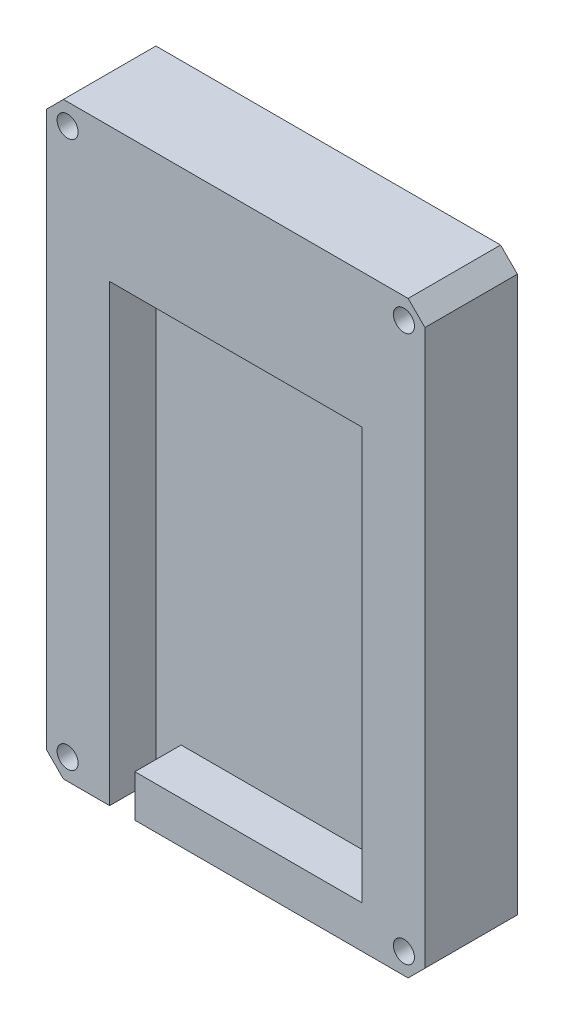
ISO-10303-21;
HEADER;
FILE_DESCRIPTION(('STEP AP214'),'2;1');
FILE_NAME('part.step','',(''),(''),'','','');
FILE_SCHEMA(('AUTOMOTIVE_DESIGN { 1 0 10303 214 1 1 1 1 }'));
ENDSEC;
DATA;
#1=APPLICATION_CONTEXT('core data for automotive mechanical design processes');
#2=APPLICATION_PROTOCOL_DEFINITION('international standard','automotive_design',2000,#1);
#3=PRODUCT_CONTEXT('',#1,'mechanical');
#4=PRODUCT('Part','Part','',(#3));
#5=PRODUCT_RELATED_PRODUCT_CATEGORY('part','',(#4));
#6=PRODUCT_DEFINITION_FORMATION('','',#4);
#7=PRODUCT_DEFINITION_CONTEXT('part definition',#1,'design');
#8=PRODUCT_DEFINITION('design','',#6,#7);
#9=PRODUCT_DEFINITION_SHAPE('','',#8);
#10=(LENGTH_UNIT() NAMED_UNIT(*) SI_UNIT(.MILLI.,.METRE.));
#11=(NAMED_UNIT(*) PLANE_ANGLE_UNIT() SI_UNIT($,.RADIAN.));
#12=(NAMED_UNIT(*) SI_UNIT($,.STERADIAN.) SOLID_ANGLE_UNIT());
#13=UNCERTAINTY_MEASURE_WITH_UNIT(LENGTH_MEASURE(1.E-05),#10,'distance_accuracy_value','');
#14=(GEOMETRIC_REPRESENTATION_CONTEXT(3) GLOBAL_UNCERTAINTY_ASSIGNED_CONTEXT((#13)) GLOBAL_UNIT_ASSIGNED_CONTEXT((#10,
#11,#12)) REPRESENTATION_CONTEXT('',''));
#15=CARTESIAN_POINT('',(0.,0.,0.));
#16=DIRECTION('',(0.,0.,1.));
#17=DIRECTION('',(1.,0.,0.));
#18=AXIS2_PLACEMENT_3D('',#15,#16,#17);
#19=CARTESIAN_POINT('',(0.,-24.5,5.5));
#20=DIRECTION('',(0.,1.,0.));
#21=DIRECTION('',(0.,0.,1.));
#22=AXIS2_PLACEMENT_3D('',#19,#20,#21);
#23=PLANE('',#22);
#24=DIRECTION('',(1.,0.,0.));
#25=VECTOR('',#24,1.);
#26=CARTESIAN_POINT('',(0.,-24.5,0.));
#27=LINE('',#26,#25);
#28=CARTESIAN_POINT('',(-12.,-24.5,0.));
#29=VERTEX_POINT('',#28);
#30=CARTESIAN_POINT('',(15.,-24.5,0.));
#31=VERTEX_POINT('',#30);
#32=EDGE_CURVE('E258',#29,#31,#27,.T.);
#33=ORIENTED_EDGE('',*,*,#32,.F.);
#34=DIRECTION('',(0.,0.,-1.));
#35=VECTOR('',#34,1.);
#36=CARTESIAN_POINT('',(-12.,-24.5,5.5));
#37=LINE('',#36,#35);
#38=CARTESIAN_POINT('',(-12.,-24.5,5.5));
#39=VERTEX_POINT('',#38);
#40=EDGE_CURVE('E188',#39,#29,#37,.T.);
#41=ORIENTED_EDGE('',*,*,#40,.F.);
#42=DIRECTION('',(1.,0.,0.));
#43=VECTOR('',#42,1.);
#44=CARTESIAN_POINT('',(0.,-24.5,5.5));
#45=LINE('',#44,#43);
#46=CARTESIAN_POINT('',(15.,-24.5,5.5));
#47=VERTEX_POINT('',#46);
#48=EDGE_CURVE('E268',#39,#47,#45,.T.);
#49=ORIENTED_EDGE('',*,*,#48,.T.);
#50=DIRECTION('',(0.,0.,-1.));
#51=VECTOR('',#50,1.);
#52=CARTESIAN_POINT('',(15.,-24.5,5.5));
#53=LINE('',#52,#51);
#54=EDGE_CURVE('E298',#47,#31,#53,.T.);
#55=ORIENTED_EDGE('',*,*,#54,.T.);
#56=EDGE_LOOP('',(#33,#41,#49,#55));
#57=FACE_BOUND('',#56,.T.);
#58=ADVANCED_FACE('F49',(#57),#23,.T.);
#59=CARTESIAN_POINT('',(-12.,0.,5.5));
#60=DIRECTION('',(1.,0.,0.));
#61=DIRECTION('',(0.,0.,-1.));
#62=AXIS2_PLACEMENT_3D('',#59,#60,#61);
#63=PLANE('',#62);
#64=DIRECTION('',(0.,-1.,0.));
#65=VECTOR('',#64,1.);
#66=CARTESIAN_POINT('',(-12.,0.,0.));
#67=LINE('',#66,#65);
#68=CARTESIAN_POINT('',(-12.,-29.5,0.));
#69=VERTEX_POINT('',#68);
#70=EDGE_CURVE('E163',#29,#69,#67,.T.);
#71=ORIENTED_EDGE('',*,*,#70,.T.);
#72=DIRECTION('',(0.,0.,-1.));
#73=VECTOR('',#72,1.);
#74=CARTESIAN_POINT('',(-12.,-29.5,5.5));
#75=LINE('',#74,#73);
#76=CARTESIAN_POINT('',(-12.,-29.5,5.5));
#77=VERTEX_POINT('',#76);
#78=EDGE_CURVE('E175',#77,#69,#75,.T.);
#79=ORIENTED_EDGE('',*,*,#78,.F.);
#80=DIRECTION('',(0.,-1.,0.));
#81=VECTOR('',#80,1.);
#82=CARTESIAN_POINT('',(-12.,0.,5.5));
#83=LINE('',#82,#81);
#84=EDGE_CURVE('E272',#39,#77,#83,.T.);
#85=ORIENTED_EDGE('',*,*,#84,.F.);
#86=ORIENTED_EDGE('',*,*,#40,.T.);
#87=EDGE_LOOP('',(#71,#79,#85,#86));
#88=FACE_BOUND('',#87,.T.);
#89=ADVANCED_FACE('F406',(#88),#63,.F.);
#90=CARTESIAN_POINT('',(22.5,0.,5.5));
#91=DIRECTION('',(-1.,0.,0.));
#92=DIRECTION('',(0.,-1.,0.));
#93=AXIS2_PLACEMENT_3D('',#90,#91,#92);
#94=PLANE('',#93);
#95=DIRECTION('',(0.,1.,0.));
#96=VECTOR('',#95,1.);
#97=CARTESIAN_POINT('',(22.5,0.,5.5));
#98=LINE('',#97,#96);
#99=CARTESIAN_POINT('',(22.5,-27.5,5.5));
#100=VERTEX_POINT('',#99);
#101=CARTESIAN_POINT('',(22.5,38.5,5.5));
#102=VERTEX_POINT('',#101);
#103=EDGE_CURVE('E280',#100,#102,#98,.T.);
#104=ORIENTED_EDGE('',*,*,#103,.F.);
#105=DIRECTION('',(0.,0.,-1.));
#106=VECTOR('',#105,1.);
#107=CARTESIAN_POINT('',(22.5,-27.5,5.5));
#108=LINE('',#107,#106);
#109=CARTESIAN_POINT('',(22.5,-27.5,-5.5));
#110=VERTEX_POINT('',#109);
#111=EDGE_CURVE('E200',#100,#110,#108,.T.);
#112=ORIENTED_EDGE('',*,*,#111,.T.);
#113=DIRECTION('',(0.,1.,0.));
#114=VECTOR('',#113,1.);
#115=CARTESIAN_POINT('',(22.5,0.,-5.5));
#116=LINE('',#115,#114);
#117=CARTESIAN_POINT('',(22.5,38.5,-5.5));
#118=VERTEX_POINT('',#117);
#119=EDGE_CURVE('E259',#110,#118,#116,.T.);
#120=ORIENTED_EDGE('',*,*,#119,.T.);
#121=DIRECTION('',(0.,0.,1.));
#122=VECTOR('',#121,1.);
#123=CARTESIAN_POINT('',(22.5,38.5,5.5));
#124=LINE('',#123,#122);
#125=EDGE_CURVE('E197',#118,#102,#124,.T.);
#126=ORIENTED_EDGE('',*,*,#125,.T.);
#127=EDGE_LOOP('',(#104,#112,#120,#126));
#128=FACE_BOUND('',#127,.T.);
#129=ADVANCED_FACE('F412',(#128),#94,.F.);
#130=CARTESIAN_POINT('',(0.,40.5,5.5));
#131=DIRECTION('',(0.,1.,0.));
#132=DIRECTION('',(0.,0.,1.));
#133=AXIS2_PLACEMENT_3D('',#130,#131,#132);
#134=PLANE('',#133);
#135=DIRECTION('',(1.,0.,0.));
#136=VECTOR('',#135,1.);
#137=CARTESIAN_POINT('',(0.,40.5,5.5));
#138=LINE('',#137,#136);
#139=CARTESIAN_POINT('',(-20.5,40.5,5.5));
#140=VERTEX_POINT('',#139);
#141=CARTESIAN_POINT('',(20.5,40.5,5.5));
#142=VERTEX_POINT('',#141);
#143=EDGE_CURVE('E249',#140,#142,#138,.T.);
#144=ORIENTED_EDGE('',*,*,#143,.T.);
#145=DIRECTION('',(0.,0.,-1.));
#146=VECTOR('',#145,1.);
#147=CARTESIAN_POINT('',(20.5,40.5,-5.5));
#148=LINE('',#147,#146);
#149=CARTESIAN_POINT('',(20.5,40.5,-5.5));
#150=VERTEX_POINT('',#149);
#151=EDGE_CURVE('E237',#142,#150,#148,.T.);
#152=ORIENTED_EDGE('',*,*,#151,.T.);
#153=DIRECTION('',(1.,0.,0.));
#154=VECTOR('',#153,1.);
#155=CARTESIAN_POINT('',(0.,40.5,-5.5));
#156=LINE('',#155,#154);
#157=CARTESIAN_POINT('',(-20.5,40.5,-5.5));
#158=VERTEX_POINT('',#157);
#159=EDGE_CURVE('E247',#158,#150,#156,.T.);
#160=ORIENTED_EDGE('',*,*,#159,.F.);
#161=DIRECTION('',(0.,0.,1.));
#162=VECTOR('',#161,1.);
#163=CARTESIAN_POINT('',(-20.5,40.5,5.5));
#164=LINE('',#163,#162);
#165=EDGE_CURVE('E234',#158,#140,#164,.T.);
#166=ORIENTED_EDGE('',*,*,#165,.T.);
#167=EDGE_LOOP('',(#144,#152,#160,#166));
#168=FACE_BOUND('',#167,.T.);
#169=ADVANCED_FACE('F246',(#168),#134,.T.);
#170=CARTESIAN_POINT('',(-22.5,0.,5.5));
#171=DIRECTION('',(-1.,0.,0.));
#172=DIRECTION('',(0.,-1.,0.));
#173=AXIS2_PLACEMENT_3D('',#170,#171,#172);
#174=PLANE('',#173);
#175=DIRECTION('',(0.,1.,0.));
#176=VECTOR('',#175,1.);
#177=CARTESIAN_POINT('',(-22.5,0.,5.5));
#178=LINE('',#177,#176);
#179=CARTESIAN_POINT('',(-22.5,-27.5,5.5));
#180=VERTEX_POINT('',#179);
#181=CARTESIAN_POINT('',(-22.5,38.5,5.5));
#182=VERTEX_POINT('',#181);
#183=EDGE_CURVE('E287',#180,#182,#178,.T.);
#184=ORIENTED_EDGE('',*,*,#183,.T.);
#185=DIRECTION('',(0.,0.,-1.));
#186=VECTOR('',#185,1.);
#187=CARTESIAN_POINT('',(-22.5,38.5,5.5));
#188=LINE('',#187,#186);
#189=CARTESIAN_POINT('',(-22.5,38.5,-5.5));
#190=VERTEX_POINT('',#189);
#191=EDGE_CURVE('E11',#182,#190,#188,.T.);
#192=ORIENTED_EDGE('',*,*,#191,.T.);
#193=DIRECTION('',(0.,1.,0.));
#194=VECTOR('',#193,1.);
#195=CARTESIAN_POINT('',(-22.5,0.,-5.5));
#196=LINE('',#195,#194);
#197=CARTESIAN_POINT('',(-22.5,-27.5,-5.5));
#198=VERTEX_POINT('',#197);
#199=EDGE_CURVE('E177',#198,#190,#196,.T.);
#200=ORIENTED_EDGE('',*,*,#199,.F.);
#201=DIRECTION('',(0.,0.,1.));
#202=VECTOR('',#201,1.);
#203=CARTESIAN_POINT('',(-22.5,-27.5,5.5));
#204=LINE('',#203,#202);
#205=EDGE_CURVE('E59',#198,#180,#204,.T.);
#206=ORIENTED_EDGE('',*,*,#205,.T.);
#207=EDGE_LOOP('',(#184,#192,#200,#206));
#208=FACE_BOUND('',#207,.T.);
#209=ADVANCED_FACE('F324',(#208),#174,.T.);
#210=CARTESIAN_POINT('',(0.,-29.5,5.5));
#211=DIRECTION('',(0.,1.,0.));
#212=DIRECTION('',(-1.,0.,0.));
#213=AXIS2_PLACEMENT_3D('',#210,#211,#212);
#214=PLANE('',#213);
#215=DIRECTION('',(1.,0.,0.));
#216=VECTOR('',#215,1.);
#217=CARTESIAN_POINT('',(0.,-29.5,-5.5));
#218=LINE('',#217,#216);
#219=CARTESIAN_POINT('',(-20.5,-29.5,-5.5));
#220=VERTEX_POINT('',#219);
#221=CARTESIAN_POINT('',(20.5,-29.5,-5.5));
#222=VERTEX_POINT('',#221);
#223=EDGE_CURVE('E264',#220,#222,#218,.T.);
#224=ORIENTED_EDGE('',*,*,#223,.T.);
#225=DIRECTION('',(0.,0.,1.));
#226=VECTOR('',#225,1.);
#227=CARTESIAN_POINT('',(20.5,-29.5,5.5));
#228=LINE('',#227,#226);
#229=CARTESIAN_POINT('',(20.5,-29.5,5.5));
#230=VERTEX_POINT('',#229);
#231=EDGE_CURVE('E220',#222,#230,#228,.T.);
#232=ORIENTED_EDGE('',*,*,#231,.T.);
#233=DIRECTION('',(1.,0.,0.));
#234=VECTOR('',#233,1.);
#235=CARTESIAN_POINT('',(0.,-29.5,5.5));
#236=LINE('',#235,#234);
#237=EDGE_CURVE('E276',#77,#230,#236,.T.);
#238=ORIENTED_EDGE('',*,*,#237,.F.);
#239=ORIENTED_EDGE('',*,*,#78,.T.);
#240=DIRECTION('',(1.,0.,0.));
#241=VECTOR('',#240,1.);
#242=CARTESIAN_POINT('',(0.,-29.5,0.));
#243=LINE('',#242,#241);
#244=CARTESIAN_POINT('',(-15.,-29.5,0.));
#245=VERTEX_POINT('',#244);
#246=EDGE_CURVE('E155',#245,#69,#243,.T.);
#247=ORIENTED_EDGE('',*,*,#246,.F.);
#248=DIRECTION('',(0.,0.,-1.));
#249=VECTOR('',#248,1.);
#250=CARTESIAN_POINT('',(-15.,-29.5,5.5));
#251=LINE('',#250,#249);
#252=CARTESIAN_POINT('',(-15.,-29.5,5.5));
#253=VERTEX_POINT('',#252);
#254=EDGE_CURVE('E171',#253,#245,#251,.T.);
#255=ORIENTED_EDGE('',*,*,#254,.F.);
#256=CARTESIAN_POINT('',(-20.5,-29.5,5.5));
#257=VERTEX_POINT('',#256);
#258=EDGE_CURVE('E281',#257,#253,#236,.T.);
#259=ORIENTED_EDGE('',*,*,#258,.F.);
#260=DIRECTION('',(0.,0.,-1.));
#261=VECTOR('',#260,1.);
#262=CARTESIAN_POINT('',(-20.5,-29.5,-5.5));
#263=LINE('',#262,#261);
#264=EDGE_CURVE('E216',#257,#220,#263,.T.);
#265=ORIENTED_EDGE('',*,*,#264,.T.);
#266=EDGE_LOOP('',(#224,#232,#238,#239,#247,#255,#259,#265));
#267=FACE_BOUND('',#266,.T.);
#268=ADVANCED_FACE('F169',(#267),#214,.F.);
#269=CARTESIAN_POINT('',(-15.,0.,5.5));
#270=DIRECTION('',(1.,0.,0.));
#271=DIRECTION('',(0.,1.,0.));
#272=AXIS2_PLACEMENT_3D('',#269,#270,#271);
#273=PLANE('',#272);
#274=DIRECTION('',(0.,-1.,0.));
#275=VECTOR('',#274,1.);
#276=CARTESIAN_POINT('',(-15.,0.,0.));
#277=LINE('',#276,#275);
#278=CARTESIAN_POINT('',(-15.,24.5,0.));
#279=VERTEX_POINT('',#278);
#280=EDGE_CURVE('E152',#279,#245,#277,.T.);
#281=ORIENTED_EDGE('',*,*,#280,.F.);
#282=DIRECTION('',(0.,0.,-1.));
#283=VECTOR('',#282,1.);
#284=CARTESIAN_POINT('',(-15.,24.5,5.5));
#285=LINE('',#284,#283);
#286=CARTESIAN_POINT('',(-15.,24.5,5.5));
#287=VERTEX_POINT('',#286);
#288=EDGE_CURVE('E184',#287,#279,#285,.T.);
#289=ORIENTED_EDGE('',*,*,#288,.F.);
#290=DIRECTION('',(0.,-1.,0.));
#291=VECTOR('',#290,1.);
#292=CARTESIAN_POINT('',(-15.,0.,5.5));
#293=LINE('',#292,#291);
#294=EDGE_CURVE('E182',#287,#253,#293,.T.);
#295=ORIENTED_EDGE('',*,*,#294,.T.);
#296=ORIENTED_EDGE('',*,*,#254,.T.);
#297=EDGE_LOOP('',(#281,#289,#295,#296));
#298=FACE_BOUND('',#297,.T.);
#299=ADVANCED_FACE('F180',(#298),#273,.T.);
#300=CARTESIAN_POINT('',(0.,24.5,5.5));
#301=DIRECTION('',(0.,1.,0.));
#302=DIRECTION('',(0.,0.,1.));
#303=AXIS2_PLACEMENT_3D('',#300,#301,#302);
#304=PLANE('',#303);
#305=DIRECTION('',(1.,0.,0.));
#306=VECTOR('',#305,1.);
#307=CARTESIAN_POINT('',(0.,24.5,0.));
#308=LINE('',#307,#306);
#309=CARTESIAN_POINT('',(15.,24.5,0.));
#310=VERTEX_POINT('',#309);
#311=EDGE_CURVE('E158',#279,#310,#308,.T.);
#312=ORIENTED_EDGE('',*,*,#311,.T.);
#313=DIRECTION('',(0.,0.,-1.));
#314=VECTOR('',#313,1.);
#315=CARTESIAN_POINT('',(15.,24.5,5.5));
#316=LINE('',#315,#314);
#317=CARTESIAN_POINT('',(15.,24.5,5.5));
#318=VERTEX_POINT('',#317);
#319=EDGE_CURVE('E190',#318,#310,#316,.T.);
#320=ORIENTED_EDGE('',*,*,#319,.F.);
#321=DIRECTION('',(1.,0.,0.));
#322=VECTOR('',#321,1.);
#323=CARTESIAN_POINT('',(0.,24.5,5.5));
#324=LINE('',#323,#322);
#325=EDGE_CURVE('E292',#287,#318,#324,.T.);
#326=ORIENTED_EDGE('',*,*,#325,.F.);
#327=ORIENTED_EDGE('',*,*,#288,.T.);
#328=EDGE_LOOP('',(#312,#320,#326,#327));
#329=FACE_BOUND('',#328,.T.);
#330=ADVANCED_FACE('F317',(#329),#304,.F.);
#331=CARTESIAN_POINT('',(15.,0.,5.5));
#332=DIRECTION('',(-1.,0.,0.));
#333=DIRECTION('',(0.,-1.,0.));
#334=AXIS2_PLACEMENT_3D('',#331,#332,#333);
#335=PLANE('',#334);
#336=DIRECTION('',(0.,1.,0.));
#337=VECTOR('',#336,1.);
#338=CARTESIAN_POINT('',(15.,0.,0.));
#339=LINE('',#338,#337);
#340=EDGE_CURVE('E273',#31,#310,#339,.T.);
#341=ORIENTED_EDGE('',*,*,#340,.F.);
#342=ORIENTED_EDGE('',*,*,#54,.F.);
#343=DIRECTION('',(0.,1.,0.));
#344=VECTOR('',#343,1.);
#345=CARTESIAN_POINT('',(15.,0.,5.5));
#346=LINE('',#345,#344);
#347=EDGE_CURVE('E295',#47,#318,#346,.T.);
#348=ORIENTED_EDGE('',*,*,#347,.T.);
#349=ORIENTED_EDGE('',*,*,#319,.T.);
#350=EDGE_LOOP('',(#341,#342,#348,#349));
#351=FACE_BOUND('',#350,.T.);
#352=ADVANCED_FACE('F313',(#351),#335,.T.);
#353=CARTESIAN_POINT('',(0.,0.,5.5));
#354=DIRECTION('',(0.,0.,1.));
#355=DIRECTION('',(1.,0.,0.));
#356=AXIS2_PLACEMENT_3D('',#353,#354,#355);
#357=PLANE('',#356);
#358=CARTESIAN_POINT('',(-20.,38.,5.5));
#359=DIRECTION('',(0.,0.,-1.));
#360=DIRECTION('',(-1.,0.,0.));
#361=AXIS2_PLACEMENT_3D('',#358,#359,#360);
#362=CIRCLE('',#361,1.25);
#363=CARTESIAN_POINT('',(-21.25,38.,5.5));
#364=VERTEX_POINT('',#363);
#365=EDGE_CURVE('E365',#364,#364,#362,.T.);
#366=ORIENTED_EDGE('',*,*,#365,.T.);
#367=EDGE_LOOP('',(#366));
#368=FACE_BOUND('',#367,.T.);
#369=CARTESIAN_POINT('',(20.,38.,5.5));
#370=DIRECTION('',(0.,0.,-1.));
#371=DIRECTION('',(-1.,0.,0.));
#372=AXIS2_PLACEMENT_3D('',#369,#370,#371);
#373=CIRCLE('',#372,1.25);
#374=CARTESIAN_POINT('',(18.75,38.,5.5));
#375=VERTEX_POINT('',#374);
#376=EDGE_CURVE('E353',#375,#375,#373,.T.);
#377=ORIENTED_EDGE('',*,*,#376,.T.);
#378=EDGE_LOOP('',(#377));
#379=FACE_BOUND('',#378,.T.);
#380=CARTESIAN_POINT('',(20.,-27.,5.5));
#381=DIRECTION('',(0.,0.,-1.));
#382=DIRECTION('',(-1.,0.,0.));
#383=AXIS2_PLACEMENT_3D('',#380,#381,#382);
#384=CIRCLE('',#383,1.25);
#385=CARTESIAN_POINT('',(18.75,-27.,5.5));
#386=VERTEX_POINT('',#385);
#387=EDGE_CURVE('E341',#386,#386,#384,.T.);
#388=ORIENTED_EDGE('',*,*,#387,.T.);
#389=EDGE_LOOP('',(#388));
#390=FACE_BOUND('',#389,.T.);
#391=CARTESIAN_POINT('',(-20.,-27.,5.5));
#392=DIRECTION('',(0.,0.,-1.));
#393=DIRECTION('',(-1.,0.,0.));
#394=AXIS2_PLACEMENT_3D('',#391,#392,#393);
#395=CIRCLE('',#394,1.25);
#396=CARTESIAN_POINT('',(-21.25,-27.,5.5));
#397=VERTEX_POINT('',#396);
#398=EDGE_CURVE('E178',#397,#397,#395,.T.);
#399=ORIENTED_EDGE('',*,*,#398,.T.);
#400=EDGE_LOOP('',(#399));
#401=FACE_BOUND('',#400,.T.);
#402=ORIENTED_EDGE('',*,*,#237,.T.);
#403=DIRECTION('',(-0.707106781186549,-0.707106781186546,0.));
#404=VECTOR('',#403,1.);
#405=CARTESIAN_POINT('',(25.,-25.,5.5));
#406=LINE('',#405,#404);
#407=EDGE_CURVE('E231',#230,#100,#406,.F.);
#408=ORIENTED_EDGE('',*,*,#407,.T.);
#409=ORIENTED_EDGE('',*,*,#103,.T.);
#410=DIRECTION('',(-0.707106781186545,0.70710678118655,0.));
#411=VECTOR('',#410,1.);
#412=CARTESIAN_POINT('',(30.5000000000001,30.4999999999999,5.5));
#413=LINE('',#412,#411);
#414=EDGE_CURVE('E228',#102,#142,#413,.T.);
#415=ORIENTED_EDGE('',*,*,#414,.T.);
#416=ORIENTED_EDGE('',*,*,#143,.F.);
#417=DIRECTION('',(0.707106781186548,0.707106781186548,0.));
#418=VECTOR('',#417,1.);
#419=CARTESIAN_POINT('',(-30.5,30.5,5.5));
#420=LINE('',#419,#418);
#421=EDGE_CURVE('E66',#140,#182,#420,.F.);
#422=ORIENTED_EDGE('',*,*,#421,.T.);
#423=ORIENTED_EDGE('',*,*,#183,.F.);
#424=DIRECTION('',(0.707106781186548,-0.707106781186548,0.));
#425=VECTOR('',#424,1.);
#426=CARTESIAN_POINT('',(-25.,-25.,5.5));
#427=LINE('',#426,#425);
#428=EDGE_CURVE('E223',#180,#257,#427,.T.);
#429=ORIENTED_EDGE('',*,*,#428,.T.);
#430=ORIENTED_EDGE('',*,*,#258,.T.);
#431=ORIENTED_EDGE('',*,*,#294,.F.);
#432=ORIENTED_EDGE('',*,*,#325,.T.);
#433=ORIENTED_EDGE('',*,*,#347,.F.);
#434=ORIENTED_EDGE('',*,*,#48,.F.);
#435=ORIENTED_EDGE('',*,*,#84,.T.);
#436=EDGE_LOOP('',(#402,#408,#409,#415,#416,#422,#423,#429,#430,#431,#432,#433,#434,#435));
#437=FACE_BOUND('',#436,.T.);
#438=ADVANCED_FACE('F318',(#368,#379,#390,#401,#437),#357,.T.);
#439=CARTESIAN_POINT('',(0.,0.,-5.5));
#440=DIRECTION('',(0.,0.,1.));
#441=DIRECTION('',(1.,0.,0.));
#442=AXIS2_PLACEMENT_3D('',#439,#440,#441);
#443=PLANE('',#442);
#444=CARTESIAN_POINT('',(-20.,38.,-5.5));
#445=DIRECTION('',(0.,0.,-1.));
#446=DIRECTION('',(-1.,0.,0.));
#447=AXIS2_PLACEMENT_3D('',#444,#445,#446);
#448=CIRCLE('',#447,1.275);
#449=CARTESIAN_POINT('',(-21.275,38.,-5.5));
#450=VERTEX_POINT('',#449);
#451=EDGE_CURVE('E373',#450,#450,#448,.T.);
#452=ORIENTED_EDGE('',*,*,#451,.F.);
#453=EDGE_LOOP('',(#452));
#454=FACE_BOUND('',#453,.T.);
#455=CARTESIAN_POINT('',(20.,38.,-5.5));
#456=DIRECTION('',(0.,0.,-1.));
#457=DIRECTION('',(-1.,0.,0.));
#458=AXIS2_PLACEMENT_3D('',#455,#456,#457);
#459=CIRCLE('',#458,1.275);
#460=CARTESIAN_POINT('',(18.725,38.,-5.5));
#461=VERTEX_POINT('',#460);
#462=EDGE_CURVE('E361',#461,#461,#459,.T.);
#463=ORIENTED_EDGE('',*,*,#462,.F.);
#464=EDGE_LOOP('',(#463));
#465=FACE_BOUND('',#464,.T.);
#466=CARTESIAN_POINT('',(20.,-27.,-5.5));
#467=DIRECTION('',(0.,0.,-1.));
#468=DIRECTION('',(-1.,0.,0.));
#469=AXIS2_PLACEMENT_3D('',#466,#467,#468);
#470=CIRCLE('',#469,1.275);
#471=CARTESIAN_POINT('',(18.725,-27.,-5.5));
#472=VERTEX_POINT('',#471);
#473=EDGE_CURVE('E349',#472,#472,#470,.T.);
#474=ORIENTED_EDGE('',*,*,#473,.F.);
#475=EDGE_LOOP('',(#474));
#476=FACE_BOUND('',#475,.T.);
#477=CARTESIAN_POINT('',(-20.,-27.,-5.5));
#478=DIRECTION('',(0.,0.,-1.));
#479=DIRECTION('',(-1.,0.,0.));
#480=AXIS2_PLACEMENT_3D('',#477,#478,#479);
#481=CIRCLE('',#480,1.275);
#482=CARTESIAN_POINT('',(-21.275,-27.,-5.5));
#483=VERTEX_POINT('',#482);
#484=EDGE_CURVE('E337',#483,#483,#481,.T.);
#485=ORIENTED_EDGE('',*,*,#484,.F.);
#486=EDGE_LOOP('',(#485));
#487=FACE_BOUND('',#486,.T.);
#488=ORIENTED_EDGE('',*,*,#119,.F.);
#489=DIRECTION('',(0.707106781186549,0.707106781186546,0.));
#490=VECTOR('',#489,1.);
#491=CARTESIAN_POINT('',(22.5,-27.5,-5.5));
#492=LINE('',#491,#490);
#493=EDGE_CURVE('E213',#110,#222,#492,.F.);
#494=ORIENTED_EDGE('',*,*,#493,.T.);
#495=ORIENTED_EDGE('',*,*,#223,.F.);
#496=DIRECTION('',(-0.707106781186548,0.707106781186548,0.));
#497=VECTOR('',#496,1.);
#498=CARTESIAN_POINT('',(-20.5,-29.5,-5.5));
#499=LINE('',#498,#497);
#500=EDGE_CURVE('E204',#220,#198,#499,.T.);
#501=ORIENTED_EDGE('',*,*,#500,.T.);
#502=ORIENTED_EDGE('',*,*,#199,.T.);
#503=DIRECTION('',(-0.707106781186548,-0.707106781186548,0.));
#504=VECTOR('',#503,1.);
#505=CARTESIAN_POINT('',(-22.5,38.5,-5.5));
#506=LINE('',#505,#504);
#507=EDGE_CURVE('E207',#190,#158,#506,.F.);
#508=ORIENTED_EDGE('',*,*,#507,.T.);
#509=ORIENTED_EDGE('',*,*,#159,.T.);
#510=DIRECTION('',(0.707106781186545,-0.70710678118655,0.));
#511=VECTOR('',#510,1.);
#512=CARTESIAN_POINT('',(20.5,40.5,-5.5));
#513=LINE('',#512,#511);
#514=EDGE_CURVE('E210',#150,#118,#513,.T.);
#515=ORIENTED_EDGE('',*,*,#514,.T.);
#516=EDGE_LOOP('',(#488,#494,#495,#501,#502,#508,#509,#515));
#517=FACE_BOUND('',#516,.T.);
#518=ADVANCED_FACE('F254',(#454,#465,#476,#487,#517),#443,.F.);
#519=CARTESIAN_POINT('',(0.,0.,0.));
#520=DIRECTION('',(0.,0.,1.));
#521=DIRECTION('',(1.,0.,0.));
#522=AXIS2_PLACEMENT_3D('',#519,#520,#521);
#523=PLANE('',#522);
#524=ORIENTED_EDGE('',*,*,#311,.F.);
#525=ORIENTED_EDGE('',*,*,#280,.T.);
#526=ORIENTED_EDGE('',*,*,#246,.T.);
#527=ORIENTED_EDGE('',*,*,#70,.F.);
#528=ORIENTED_EDGE('',*,*,#32,.T.);
#529=ORIENTED_EDGE('',*,*,#340,.T.);
#530=EDGE_LOOP('',(#524,#525,#526,#527,#528,#529));
#531=FACE_BOUND('',#530,.T.);
#532=ADVANCED_FACE('F154',(#531),#523,.T.);
#533=CARTESIAN_POINT('',(-20.,-27.,-5.5));
#534=DIRECTION('',(0.,0.,-1.));
#535=DIRECTION('',(-1.,0.,0.));
#536=AXIS2_PLACEMENT_3D('',#533,#534,#535);
#537=CYLINDRICAL_SURFACE('',#536,1.25);
#538=ORIENTED_EDGE('',*,*,#398,.F.);
#539=EDGE_LOOP('',(#538));
#540=FACE_BOUND('',#539,.T.);
#541=CARTESIAN_POINT('',(-20.,-27.,-5.475));
#542=DIRECTION('',(0.,0.,-1.));
#543=DIRECTION('',(-1.,0.,0.));
#544=AXIS2_PLACEMENT_3D('',#541,#542,#543);
#545=CIRCLE('',#544,1.25);
#546=CARTESIAN_POINT('',(-21.25,-27.,-5.475));
#547=VERTEX_POINT('',#546);
#548=EDGE_CURVE('E333',#547,#547,#545,.T.);
#549=ORIENTED_EDGE('',*,*,#548,.T.);
#550=EDGE_LOOP('',(#549));
#551=FACE_BOUND('',#550,.T.);
#552=ADVANCED_FACE('F392',(#540,#551),#537,.F.);
#553=CARTESIAN_POINT('',(-20.,-27.,-5.5));
#554=DIRECTION('',(0.,0.,-1.));
#555=DIRECTION('',(-1.,0.,0.));
#556=AXIS2_PLACEMENT_3D('',#553,#554,#555);
#557=CONICAL_SURFACE('',#556,1.275,0.785398163397414);
#558=ORIENTED_EDGE('',*,*,#548,.F.);
#559=EDGE_LOOP('',(#558));
#560=FACE_BOUND('',#559,.T.);
#561=ORIENTED_EDGE('',*,*,#484,.T.);
#562=EDGE_LOOP('',(#561));
#563=FACE_BOUND('',#562,.T.);
#564=ADVANCED_FACE('F389',(#560,#563),#557,.F.);
#565=CARTESIAN_POINT('',(20.,-27.,-5.5));
#566=DIRECTION('',(0.,0.,-1.));
#567=DIRECTION('',(-1.,0.,0.));
#568=AXIS2_PLACEMENT_3D('',#565,#566,#567);
#569=CYLINDRICAL_SURFACE('',#568,1.25);
#570=ORIENTED_EDGE('',*,*,#387,.F.);
#571=EDGE_LOOP('',(#570));
#572=FACE_BOUND('',#571,.T.);
#573=CARTESIAN_POINT('',(20.,-27.,-5.475));
#574=DIRECTION('',(0.,0.,-1.));
#575=DIRECTION('',(-1.,0.,0.));
#576=AXIS2_PLACEMENT_3D('',#573,#574,#575);
#577=CIRCLE('',#576,1.25);
#578=CARTESIAN_POINT('',(18.75,-27.,-5.475));
#579=VERTEX_POINT('',#578);
#580=EDGE_CURVE('E345',#579,#579,#577,.T.);
#581=ORIENTED_EDGE('',*,*,#580,.T.);
#582=EDGE_LOOP('',(#581));
#583=FACE_BOUND('',#582,.T.);
#584=ADVANCED_FACE('F391',(#572,#583),#569,.F.);
#585=CARTESIAN_POINT('',(20.,-27.,-5.5));
#586=DIRECTION('',(0.,0.,-1.));
#587=DIRECTION('',(-1.,0.,0.));
#588=AXIS2_PLACEMENT_3D('',#585,#586,#587);
#589=CONICAL_SURFACE('',#588,1.275,0.785398163397414);
#590=ORIENTED_EDGE('',*,*,#580,.F.);
#591=EDGE_LOOP('',(#590));
#592=FACE_BOUND('',#591,.T.);
#593=ORIENTED_EDGE('',*,*,#473,.T.);
#594=EDGE_LOOP('',(#593));
#595=FACE_BOUND('',#594,.T.);
#596=ADVANCED_FACE('F399',(#592,#595),#589,.F.);
#597=CARTESIAN_POINT('',(20.,38.,-5.5));
#598=DIRECTION('',(0.,0.,-1.));
#599=DIRECTION('',(-1.,0.,0.));
#600=AXIS2_PLACEMENT_3D('',#597,#598,#599);
#601=CYLINDRICAL_SURFACE('',#600,1.25);
#602=ORIENTED_EDGE('',*,*,#376,.F.);
#603=EDGE_LOOP('',(#602));
#604=FACE_BOUND('',#603,.T.);
#605=CARTESIAN_POINT('',(20.,38.,-5.475));
#606=DIRECTION('',(0.,0.,-1.));
#607=DIRECTION('',(-1.,0.,0.));
#608=AXIS2_PLACEMENT_3D('',#605,#606,#607);
#609=CIRCLE('',#608,1.25);
#610=CARTESIAN_POINT('',(18.75,38.,-5.475));
#611=VERTEX_POINT('',#610);
#612=EDGE_CURVE('E357',#611,#611,#609,.T.);
#613=ORIENTED_EDGE('',*,*,#612,.T.);
#614=EDGE_LOOP('',(#613));
#615=FACE_BOUND('',#614,.T.);
#616=ADVANCED_FACE('F494',(#604,#615),#601,.F.);
#617=CARTESIAN_POINT('',(20.,38.,-5.5));
#618=DIRECTION('',(0.,0.,-1.));
#619=DIRECTION('',(-1.,0.,0.));
#620=AXIS2_PLACEMENT_3D('',#617,#618,#619);
#621=CONICAL_SURFACE('',#620,1.275,0.785398163397414);
#622=ORIENTED_EDGE('',*,*,#612,.F.);
#623=EDGE_LOOP('',(#622));
#624=FACE_BOUND('',#623,.T.);
#625=ORIENTED_EDGE('',*,*,#462,.T.);
#626=EDGE_LOOP('',(#625));
#627=FACE_BOUND('',#626,.T.);
#628=ADVANCED_FACE('F504',(#624,#627),#621,.F.);
#629=CARTESIAN_POINT('',(-20.,38.,-5.5));
#630=DIRECTION('',(0.,0.,-1.));
#631=DIRECTION('',(-1.,0.,0.));
#632=AXIS2_PLACEMENT_3D('',#629,#630,#631);
#633=CYLINDRICAL_SURFACE('',#632,1.25);
#634=ORIENTED_EDGE('',*,*,#365,.F.);
#635=EDGE_LOOP('',(#634));
#636=FACE_BOUND('',#635,.T.);
#637=CARTESIAN_POINT('',(-20.,38.,-5.475));
#638=DIRECTION('',(0.,0.,-1.));
#639=DIRECTION('',(-1.,0.,0.));
#640=AXIS2_PLACEMENT_3D('',#637,#638,#639);
#641=CIRCLE('',#640,1.25);
#642=CARTESIAN_POINT('',(-21.25,38.,-5.475));
#643=VERTEX_POINT('',#642);
#644=EDGE_CURVE('E369',#643,#643,#641,.T.);
#645=ORIENTED_EDGE('',*,*,#644,.T.);
#646=EDGE_LOOP('',(#645));
#647=FACE_BOUND('',#646,.T.);
#648=ADVANCED_FACE('F514',(#636,#647),#633,.F.);
#649=CARTESIAN_POINT('',(-20.,38.,-5.5));
#650=DIRECTION('',(0.,0.,-1.));
#651=DIRECTION('',(-1.,0.,0.));
#652=AXIS2_PLACEMENT_3D('',#649,#650,#651);
#653=CONICAL_SURFACE('',#652,1.275,0.785398163397414);
#654=ORIENTED_EDGE('',*,*,#644,.F.);
#655=EDGE_LOOP('',(#654));
#656=FACE_BOUND('',#655,.T.);
#657=ORIENTED_EDGE('',*,*,#451,.T.);
#658=EDGE_LOOP('',(#657));
#659=FACE_BOUND('',#658,.T.);
#660=ADVANCED_FACE('F378',(#656,#659),#653,.F.);
#661=CARTESIAN_POINT('',(22.5,-27.5,5.5));
#662=DIRECTION('',(-0.707106781186546,0.707106781186549,0.));
#663=DIRECTION('',(0.,0.,-1.));
#664=AXIS2_PLACEMENT_3D('',#661,#662,#663);
#665=PLANE('',#664);
#666=ORIENTED_EDGE('',*,*,#407,.F.);
#667=ORIENTED_EDGE('',*,*,#231,.F.);
#668=ORIENTED_EDGE('',*,*,#493,.F.);
#669=ORIENTED_EDGE('',*,*,#111,.F.);
#670=EDGE_LOOP('',(#666,#667,#668,#669));
#671=FACE_BOUND('',#670,.T.);
#672=ADVANCED_FACE('F419',(#671),#665,.F.);
#673=CARTESIAN_POINT('',(20.5,40.5,5.5));
#674=DIRECTION('',(0.70710678118655,0.707106781186545,0.));
#675=DIRECTION('',(0.,0.,1.));
#676=AXIS2_PLACEMENT_3D('',#673,#674,#675);
#677=PLANE('',#676);
#678=ORIENTED_EDGE('',*,*,#414,.F.);
#679=ORIENTED_EDGE('',*,*,#125,.F.);
#680=ORIENTED_EDGE('',*,*,#514,.F.);
#681=ORIENTED_EDGE('',*,*,#151,.F.);
#682=EDGE_LOOP('',(#678,#679,#680,#681));
#683=FACE_BOUND('',#682,.T.);
#684=ADVANCED_FACE('F425',(#683),#677,.T.);
#685=CARTESIAN_POINT('',(-22.5,38.5,5.5));
#686=DIRECTION('',(0.707106781186547,-0.707106781186547,0.));
#687=DIRECTION('',(0.,0.,-1.));
#688=AXIS2_PLACEMENT_3D('',#685,#686,#687);
#689=PLANE('',#688);
#690=ORIENTED_EDGE('',*,*,#421,.F.);
#691=ORIENTED_EDGE('',*,*,#165,.F.);
#692=ORIENTED_EDGE('',*,*,#507,.F.);
#693=ORIENTED_EDGE('',*,*,#191,.F.);
#694=EDGE_LOOP('',(#690,#691,#692,#693));
#695=FACE_BOUND('',#694,.T.);
#696=ADVANCED_FACE('F431',(#695),#689,.F.);
#697=CARTESIAN_POINT('',(-20.5,-29.5,5.5));
#698=DIRECTION('',(-0.707106781186547,-0.707106781186547,0.));
#699=DIRECTION('',(0.,0.,1.));
#700=AXIS2_PLACEMENT_3D('',#697,#698,#699);
#701=PLANE('',#700);
#702=ORIENTED_EDGE('',*,*,#428,.F.);
#703=ORIENTED_EDGE('',*,*,#205,.F.);
#704=ORIENTED_EDGE('',*,*,#500,.F.);
#705=ORIENTED_EDGE('',*,*,#264,.F.);
#706=EDGE_LOOP('',(#702,#703,#704,#705));
#707=FACE_BOUND('',#706,.T.);
#708=ADVANCED_FACE('F52',(#707),#701,.T.);
#709=CLOSED_SHELL('',(#58,#89,#129,#169,#209,#268,#299,#330,#352,#438,#518,#532,#552,#564,#584,
#596,#616,#628,#648,#660,#672,#684,#696,#708));
#710=MANIFOLD_SOLID_BREP('B2',#709);
#711=ADVANCED_BREP_SHAPE_REPRESENTATION('',(#18,#710),#14);
#712=SHAPE_DEFINITION_REPRESENTATION(#9,#711);
ENDSEC;
END-ISO-10303-21;
